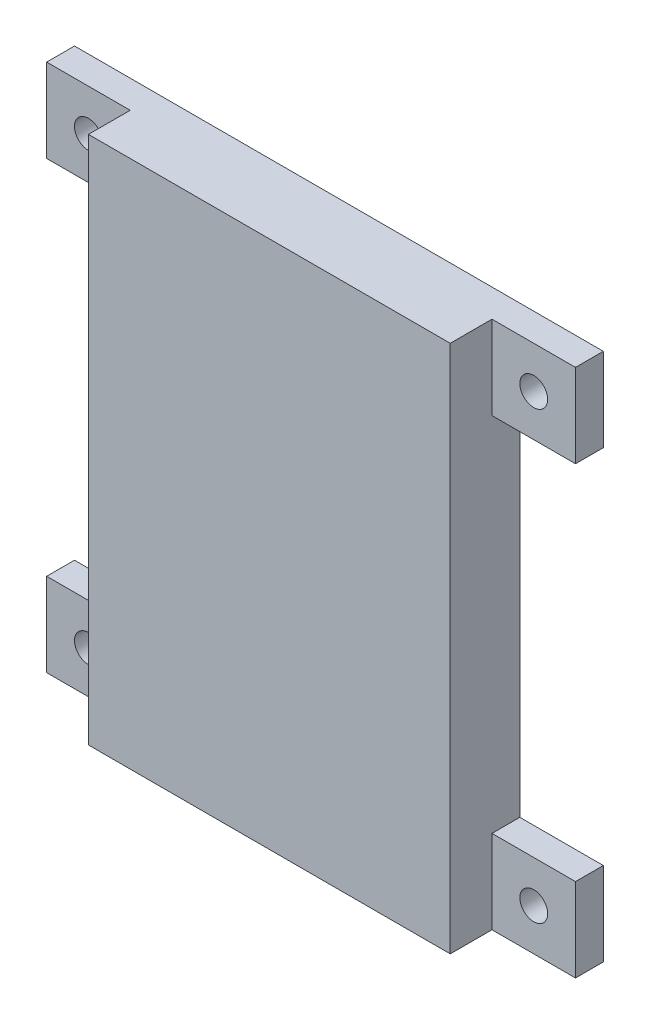
ISO-10303-21;
HEADER;
FILE_DESCRIPTION(('STEP AP214'),'2;1');
FILE_NAME('part.step','',(''),(''),'','','');
FILE_SCHEMA(('AUTOMOTIVE_DESIGN { 1 0 10303 214 1 1 1 1 }'));
ENDSEC;
DATA;
#1=APPLICATION_CONTEXT('core data for automotive mechanical design processes');
#2=APPLICATION_PROTOCOL_DEFINITION('international standard','automotive_design',2000,#1);
#3=PRODUCT_CONTEXT('',#1,'mechanical');
#4=PRODUCT('Part','Part','',(#3));
#5=PRODUCT_RELATED_PRODUCT_CATEGORY('part','',(#4));
#6=PRODUCT_DEFINITION_FORMATION('','',#4);
#7=PRODUCT_DEFINITION_CONTEXT('part definition',#1,'design');
#8=PRODUCT_DEFINITION('design','',#6,#7);
#9=PRODUCT_DEFINITION_SHAPE('','',#8);
#10=(LENGTH_UNIT() NAMED_UNIT(*) SI_UNIT(.MILLI.,.METRE.));
#11=(NAMED_UNIT(*) PLANE_ANGLE_UNIT() SI_UNIT($,.RADIAN.));
#12=(NAMED_UNIT(*) SI_UNIT($,.STERADIAN.) SOLID_ANGLE_UNIT());
#13=UNCERTAINTY_MEASURE_WITH_UNIT(LENGTH_MEASURE(1.E-05),#10,'distance_accuracy_value','');
#14=(GEOMETRIC_REPRESENTATION_CONTEXT(3) GLOBAL_UNCERTAINTY_ASSIGNED_CONTEXT((#13)) GLOBAL_UNIT_ASSIGNED_CONTEXT((#10,
#11,#12)) REPRESENTATION_CONTEXT('',''));
#15=CARTESIAN_POINT('',(0.,0.,0.));
#16=DIRECTION('',(0.,0.,1.));
#17=DIRECTION('',(1.,0.,0.));
#18=AXIS2_PLACEMENT_3D('',#15,#16,#17);
#19=CARTESIAN_POINT('',(-13.,19.,0.));
#20=DIRECTION('',(0.,0.,1.));
#21=DIRECTION('',(1.,0.,0.));
#22=AXIS2_PLACEMENT_3D('',#19,#20,#21);
#23=PLANE('',#22);
#24=CARTESIAN_POINT('',(16.,-16.,0.));
#25=DIRECTION('',(0.,0.,1.));
#26=DIRECTION('',(1.,0.,0.));
#27=AXIS2_PLACEMENT_3D('',#24,#25,#26);
#28=CIRCLE('',#27,1.00000000000001);
#29=CARTESIAN_POINT('',(17.,-16.,0.));
#30=VERTEX_POINT('',#29);
#31=EDGE_CURVE('E618',#30,#30,#28,.T.);
#32=ORIENTED_EDGE('',*,*,#31,.T.);
#33=EDGE_LOOP('',(#32));
#34=FACE_BOUND('',#33,.T.);
#35=CARTESIAN_POINT('',(-16.,16.,0.));
#36=DIRECTION('',(0.,0.,1.));
#37=DIRECTION('',(1.,0.,0.));
#38=AXIS2_PLACEMENT_3D('',#35,#36,#37);
#39=CIRCLE('',#38,1.);
#40=CARTESIAN_POINT('',(-15.,16.,0.));
#41=VERTEX_POINT('',#40);
#42=EDGE_CURVE('E629',#41,#41,#39,.T.);
#43=ORIENTED_EDGE('',*,*,#42,.T.);
#44=EDGE_LOOP('',(#43));
#45=FACE_BOUND('',#44,.T.);
#46=DIRECTION('',(0.,-1.,0.));
#47=VECTOR('',#46,1.);
#48=CARTESIAN_POINT('',(-13.,-19.,0.));
#49=LINE('',#48,#47);
#50=CARTESIAN_POINT('',(-13.,13.,0.));
#51=VERTEX_POINT('',#50);
#52=CARTESIAN_POINT('',(-13.,-13.,0.));
#53=VERTEX_POINT('',#52);
#54=EDGE_CURVE('E37',#51,#53,#49,.T.);
#55=ORIENTED_EDGE('',*,*,#54,.F.);
#56=DIRECTION('',(1.,0.,0.));
#57=VECTOR('',#56,1.);
#58=CARTESIAN_POINT('',(-13.,13.,0.));
#59=LINE('',#58,#57);
#60=CARTESIAN_POINT('',(-19.,13.,0.));
#61=VERTEX_POINT('',#60);
#62=EDGE_CURVE('E201',#61,#51,#59,.T.);
#63=ORIENTED_EDGE('',*,*,#62,.F.);
#64=DIRECTION('',(0.,-1.,0.));
#65=VECTOR('',#64,1.);
#66=CARTESIAN_POINT('',(-19.,19.,0.));
#67=LINE('',#66,#65);
#68=CARTESIAN_POINT('',(-19.,19.,0.));
#69=VERTEX_POINT('',#68);
#70=EDGE_CURVE('E199',#69,#61,#67,.T.);
#71=ORIENTED_EDGE('',*,*,#70,.F.);
#72=DIRECTION('',(-1.,0.,0.));
#73=VECTOR('',#72,1.);
#74=CARTESIAN_POINT('',(13.,19.,0.));
#75=LINE('',#74,#73);
#76=CARTESIAN_POINT('',(19.,19.,0.));
#77=VERTEX_POINT('',#76);
#78=EDGE_CURVE('E185',#77,#69,#75,.T.);
#79=ORIENTED_EDGE('',*,*,#78,.F.);
#80=DIRECTION('',(0.,1.,0.));
#81=VECTOR('',#80,1.);
#82=CARTESIAN_POINT('',(19.,19.,0.));
#83=LINE('',#82,#81);
#84=CARTESIAN_POINT('',(19.,13.,0.));
#85=VERTEX_POINT('',#84);
#86=EDGE_CURVE('E314',#85,#77,#83,.T.);
#87=ORIENTED_EDGE('',*,*,#86,.F.);
#88=DIRECTION('',(1.,0.,0.));
#89=VECTOR('',#88,1.);
#90=CARTESIAN_POINT('',(13.,13.,0.));
#91=LINE('',#90,#89);
#92=CARTESIAN_POINT('',(13.,13.,0.));
#93=VERTEX_POINT('',#92);
#94=EDGE_CURVE('E312',#93,#85,#91,.T.);
#95=ORIENTED_EDGE('',*,*,#94,.F.);
#96=DIRECTION('',(0.,1.,0.));
#97=VECTOR('',#96,1.);
#98=CARTESIAN_POINT('',(13.,-19.,0.));
#99=LINE('',#98,#97);
#100=CARTESIAN_POINT('',(13.,-13.,0.));
#101=VERTEX_POINT('',#100);
#102=EDGE_CURVE('E242',#101,#93,#99,.T.);
#103=ORIENTED_EDGE('',*,*,#102,.F.);
#104=DIRECTION('',(-1.,0.,0.));
#105=VECTOR('',#104,1.);
#106=CARTESIAN_POINT('',(13.,-13.,0.));
#107=LINE('',#106,#105);
#108=CARTESIAN_POINT('',(19.,-13.,0.));
#109=VERTEX_POINT('',#108);
#110=EDGE_CURVE('E367',#109,#101,#107,.T.);
#111=ORIENTED_EDGE('',*,*,#110,.F.);
#112=DIRECTION('',(0.,1.,0.));
#113=VECTOR('',#112,1.);
#114=CARTESIAN_POINT('',(19.,-19.,0.));
#115=LINE('',#114,#113);
#116=CARTESIAN_POINT('',(19.,-19.,0.));
#117=VERTEX_POINT('',#116);
#118=EDGE_CURVE('E229',#117,#109,#115,.T.);
#119=ORIENTED_EDGE('',*,*,#118,.F.);
#120=DIRECTION('',(1.,0.,0.));
#121=VECTOR('',#120,1.);
#122=CARTESIAN_POINT('',(13.,-19.,0.));
#123=LINE('',#122,#121);
#124=CARTESIAN_POINT('',(-19.,-19.,0.));
#125=VERTEX_POINT('',#124);
#126=EDGE_CURVE('E262',#125,#117,#123,.T.);
#127=ORIENTED_EDGE('',*,*,#126,.F.);
#128=DIRECTION('',(0.,-1.,0.));
#129=VECTOR('',#128,1.);
#130=CARTESIAN_POINT('',(-19.,-19.,0.));
#131=LINE('',#130,#129);
#132=CARTESIAN_POINT('',(-19.,-13.,0.));
#133=VERTEX_POINT('',#132);
#134=EDGE_CURVE('E213',#133,#125,#131,.T.);
#135=ORIENTED_EDGE('',*,*,#134,.F.);
#136=DIRECTION('',(-1.,0.,0.));
#137=VECTOR('',#136,1.);
#138=CARTESIAN_POINT('',(-13.,-13.,0.));
#139=LINE('',#138,#137);
#140=EDGE_CURVE('E188',#53,#133,#139,.T.);
#141=ORIENTED_EDGE('',*,*,#140,.F.);
#142=EDGE_LOOP('',(#55,#63,#71,#79,#87,#95,#103,#111,#119,#127,#135,#141));
#143=FACE_BOUND('',#142,.T.);
#144=DIRECTION('',(0.,-1.,0.));
#145=VECTOR('',#144,1.);
#146=CARTESIAN_POINT('',(-11.,-17.,0.));
#147=LINE('',#146,#145);
#148=CARTESIAN_POINT('',(-11.,17.,0.));
#149=VERTEX_POINT('',#148);
#150=CARTESIAN_POINT('',(-11.,-17.,0.));
#151=VERTEX_POINT('',#150);
#152=EDGE_CURVE('E293',#149,#151,#147,.T.);
#153=ORIENTED_EDGE('',*,*,#152,.T.);
#154=DIRECTION('',(1.,0.,0.));
#155=VECTOR('',#154,1.);
#156=CARTESIAN_POINT('',(11.,-17.,0.));
#157=LINE('',#156,#155);
#158=CARTESIAN_POINT('',(11.,-17.,0.));
#159=VERTEX_POINT('',#158);
#160=EDGE_CURVE('E290',#151,#159,#157,.T.);
#161=ORIENTED_EDGE('',*,*,#160,.T.);
#162=DIRECTION('',(0.,1.,0.));
#163=VECTOR('',#162,1.);
#164=CARTESIAN_POINT('',(11.,-17.,0.));
#165=LINE('',#164,#163);
#166=CARTESIAN_POINT('',(11.,17.,0.));
#167=VERTEX_POINT('',#166);
#168=EDGE_CURVE('E287',#159,#167,#165,.T.);
#169=ORIENTED_EDGE('',*,*,#168,.T.);
#170=DIRECTION('',(-1.,0.,0.));
#171=VECTOR('',#170,1.);
#172=CARTESIAN_POINT('',(11.,17.,0.));
#173=LINE('',#172,#171);
#174=EDGE_CURVE('E283',#167,#149,#173,.T.);
#175=ORIENTED_EDGE('',*,*,#174,.T.);
#176=EDGE_LOOP('',(#153,#161,#169,#175));
#177=FACE_BOUND('',#176,.T.);
#178=CARTESIAN_POINT('',(-16.,-16.,0.));
#179=DIRECTION('',(0.,0.,1.));
#180=DIRECTION('',(1.,0.,0.));
#181=AXIS2_PLACEMENT_3D('',#178,#179,#180);
#182=CIRCLE('',#181,1.);
#183=CARTESIAN_POINT('',(-15.,-16.,0.));
#184=VERTEX_POINT('',#183);
#185=EDGE_CURVE('E624',#184,#184,#182,.T.);
#186=ORIENTED_EDGE('',*,*,#185,.T.);
#187=EDGE_LOOP('',(#186));
#188=FACE_BOUND('',#187,.T.);
#189=CARTESIAN_POINT('',(16.,16.,0.));
#190=DIRECTION('',(0.,0.,1.));
#191=DIRECTION('',(1.,0.,0.));
#192=AXIS2_PLACEMENT_3D('',#189,#190,#191);
#193=CIRCLE('',#192,1.);
#194=CARTESIAN_POINT('',(17.,16.,0.));
#195=VERTEX_POINT('',#194);
#196=EDGE_CURVE('E615',#195,#195,#193,.T.);
#197=ORIENTED_EDGE('',*,*,#196,.T.);
#198=EDGE_LOOP('',(#197));
#199=FACE_BOUND('',#198,.T.);
#200=ADVANCED_FACE('F33',(#34,#45,#143,#177,#188,#199),#23,.F.);
#201=CARTESIAN_POINT('',(13.,13.,2.));
#202=DIRECTION('',(0.,0.,1.));
#203=DIRECTION('',(1.,0.,0.));
#204=AXIS2_PLACEMENT_3D('',#201,#202,#203);
#205=PLANE('',#204);
#206=DIRECTION('',(0.,-1.,0.));
#207=VECTOR('',#206,1.);
#208=CARTESIAN_POINT('',(13.,19.,2.));
#209=LINE('',#208,#207);
#210=CARTESIAN_POINT('',(13.,19.,2.));
#211=VERTEX_POINT('',#210);
#212=CARTESIAN_POINT('',(13.,13.,2.));
#213=VERTEX_POINT('',#212);
#214=EDGE_CURVE('E253',#211,#213,#209,.T.);
#215=ORIENTED_EDGE('',*,*,#214,.T.);
#216=DIRECTION('',(1.,0.,0.));
#217=VECTOR('',#216,1.);
#218=CARTESIAN_POINT('',(13.,13.,2.));
#219=LINE('',#218,#217);
#220=CARTESIAN_POINT('',(19.,13.,2.));
#221=VERTEX_POINT('',#220);
#222=EDGE_CURVE('E326',#213,#221,#219,.T.);
#223=ORIENTED_EDGE('',*,*,#222,.T.);
#224=DIRECTION('',(0.,1.,0.));
#225=VECTOR('',#224,1.);
#226=CARTESIAN_POINT('',(19.,19.,2.));
#227=LINE('',#226,#225);
#228=CARTESIAN_POINT('',(19.,19.,2.));
#229=VERTEX_POINT('',#228);
#230=EDGE_CURVE('E321',#221,#229,#227,.T.);
#231=ORIENTED_EDGE('',*,*,#230,.T.);
#232=DIRECTION('',(-1.,0.,0.));
#233=VECTOR('',#232,1.);
#234=CARTESIAN_POINT('',(13.,19.,2.));
#235=LINE('',#234,#233);
#236=EDGE_CURVE('E318',#229,#211,#235,.T.);
#237=ORIENTED_EDGE('',*,*,#236,.T.);
#238=EDGE_LOOP('',(#215,#223,#231,#237));
#239=FACE_BOUND('',#238,.T.);
#240=CARTESIAN_POINT('',(16.,16.,2.));
#241=DIRECTION('',(0.,0.,1.));
#242=DIRECTION('',(1.,0.,0.));
#243=AXIS2_PLACEMENT_3D('',#240,#241,#242);
#244=CIRCLE('',#243,1.);
#245=CARTESIAN_POINT('',(17.,16.,2.));
#246=VERTEX_POINT('',#245);
#247=EDGE_CURVE('E612',#246,#246,#244,.T.);
#248=ORIENTED_EDGE('',*,*,#247,.F.);
#249=EDGE_LOOP('',(#248));
#250=FACE_BOUND('',#249,.T.);
#251=ADVANCED_FACE('F337',(#239,#250),#205,.T.);
#252=CARTESIAN_POINT('',(13.,-13.,2.));
#253=DIRECTION('',(0.,0.,-1.));
#254=DIRECTION('',(-1.,0.,0.));
#255=AXIS2_PLACEMENT_3D('',#252,#253,#254);
#256=PLANE('',#255);
#257=DIRECTION('',(0.,-1.,0.));
#258=VECTOR('',#257,1.);
#259=CARTESIAN_POINT('',(13.,-19.,2.));
#260=LINE('',#259,#258);
#261=CARTESIAN_POINT('',(13.,-13.,2.));
#262=VERTEX_POINT('',#261);
#263=CARTESIAN_POINT('',(13.,-19.,2.));
#264=VERTEX_POINT('',#263);
#265=EDGE_CURVE('E225',#262,#264,#260,.T.);
#266=ORIENTED_EDGE('',*,*,#265,.T.);
#267=DIRECTION('',(1.,0.,0.));
#268=VECTOR('',#267,1.);
#269=CARTESIAN_POINT('',(13.,-19.,2.));
#270=LINE('',#269,#268);
#271=CARTESIAN_POINT('',(19.,-19.,2.));
#272=VERTEX_POINT('',#271);
#273=EDGE_CURVE('E356',#264,#272,#270,.T.);
#274=ORIENTED_EDGE('',*,*,#273,.T.);
#275=DIRECTION('',(0.,1.,0.));
#276=VECTOR('',#275,1.);
#277=CARTESIAN_POINT('',(19.,-19.,2.));
#278=LINE('',#277,#276);
#279=CARTESIAN_POINT('',(19.,-13.,2.));
#280=VERTEX_POINT('',#279);
#281=EDGE_CURVE('E361',#272,#280,#278,.T.);
#282=ORIENTED_EDGE('',*,*,#281,.T.);
#283=DIRECTION('',(-1.,0.,0.));
#284=VECTOR('',#283,1.);
#285=CARTESIAN_POINT('',(13.,-13.,2.));
#286=LINE('',#285,#284);
#287=EDGE_CURVE('E365',#280,#262,#286,.T.);
#288=ORIENTED_EDGE('',*,*,#287,.T.);
#289=EDGE_LOOP('',(#266,#274,#282,#288));
#290=FACE_BOUND('',#289,.T.);
#291=CARTESIAN_POINT('',(16.,-16.,2.));
#292=DIRECTION('',(0.,0.,1.));
#293=DIRECTION('',(1.,0.,0.));
#294=AXIS2_PLACEMENT_3D('',#291,#292,#293);
#295=CIRCLE('',#294,1.00000000000001);
#296=CARTESIAN_POINT('',(17.,-16.,2.));
#297=VERTEX_POINT('',#296);
#298=EDGE_CURVE('E621',#297,#297,#295,.T.);
#299=ORIENTED_EDGE('',*,*,#298,.F.);
#300=EDGE_LOOP('',(#299));
#301=FACE_BOUND('',#300,.T.);
#302=ADVANCED_FACE('F362',(#290,#301),#256,.F.);
#303=CARTESIAN_POINT('',(-13.,-13.,2.));
#304=DIRECTION('',(0.,0.,1.));
#305=DIRECTION('',(1.,0.,0.));
#306=AXIS2_PLACEMENT_3D('',#303,#304,#305);
#307=PLANE('',#306);
#308=DIRECTION('',(0.,1.,0.));
#309=VECTOR('',#308,1.);
#310=CARTESIAN_POINT('',(-13.,-19.,2.));
#311=LINE('',#310,#309);
#312=CARTESIAN_POINT('',(-13.,-19.,2.));
#313=VERTEX_POINT('',#312);
#314=CARTESIAN_POINT('',(-13.,-13.,2.));
#315=VERTEX_POINT('',#314);
#316=EDGE_CURVE('E210',#313,#315,#311,.T.);
#317=ORIENTED_EDGE('',*,*,#316,.T.);
#318=DIRECTION('',(-1.,0.,0.));
#319=VECTOR('',#318,1.);
#320=CARTESIAN_POINT('',(-13.,-13.,2.));
#321=LINE('',#320,#319);
#322=CARTESIAN_POINT('',(-19.,-13.,2.));
#323=VERTEX_POINT('',#322);
#324=EDGE_CURVE('E207',#315,#323,#321,.T.);
#325=ORIENTED_EDGE('',*,*,#324,.T.);
#326=DIRECTION('',(0.,-1.,0.));
#327=VECTOR('',#326,1.);
#328=CARTESIAN_POINT('',(-19.,-19.,2.));
#329=LINE('',#328,#327);
#330=CARTESIAN_POINT('',(-19.,-19.,2.));
#331=VERTEX_POINT('',#330);
#332=EDGE_CURVE('E209',#323,#331,#329,.T.);
#333=ORIENTED_EDGE('',*,*,#332,.T.);
#334=DIRECTION('',(1.,0.,0.));
#335=VECTOR('',#334,1.);
#336=CARTESIAN_POINT('',(-13.,-19.,2.));
#337=LINE('',#336,#335);
#338=EDGE_CURVE('E212',#331,#313,#337,.T.);
#339=ORIENTED_EDGE('',*,*,#338,.T.);
#340=EDGE_LOOP('',(#317,#325,#333,#339));
#341=FACE_BOUND('',#340,.T.);
#342=CARTESIAN_POINT('',(-16.,-16.,2.));
#343=DIRECTION('',(0.,0.,1.));
#344=DIRECTION('',(1.,0.,0.));
#345=AXIS2_PLACEMENT_3D('',#342,#343,#344);
#346=CIRCLE('',#345,1.);
#347=CARTESIAN_POINT('',(-15.,-16.,2.));
#348=VERTEX_POINT('',#347);
#349=EDGE_CURVE('E626',#348,#348,#346,.T.);
#350=ORIENTED_EDGE('',*,*,#349,.F.);
#351=EDGE_LOOP('',(#350));
#352=FACE_BOUND('',#351,.T.);
#353=ADVANCED_FACE('F553',(#341,#352),#307,.T.);
#354=CARTESIAN_POINT('',(-13.,13.,2.));
#355=DIRECTION('',(0.,0.,-1.));
#356=DIRECTION('',(-1.,0.,0.));
#357=AXIS2_PLACEMENT_3D('',#354,#355,#356);
#358=PLANE('',#357);
#359=DIRECTION('',(0.,1.,0.));
#360=VECTOR('',#359,1.);
#361=CARTESIAN_POINT('',(-13.,19.,2.));
#362=LINE('',#361,#360);
#363=CARTESIAN_POINT('',(-13.,13.,2.));
#364=VERTEX_POINT('',#363);
#365=CARTESIAN_POINT('',(-13.,19.,2.));
#366=VERTEX_POINT('',#365);
#367=EDGE_CURVE('E51',#364,#366,#362,.T.);
#368=ORIENTED_EDGE('',*,*,#367,.T.);
#369=DIRECTION('',(-1.,0.,0.));
#370=VECTOR('',#369,1.);
#371=CARTESIAN_POINT('',(-13.,19.,2.));
#372=LINE('',#371,#370);
#373=CARTESIAN_POINT('',(-19.,19.,2.));
#374=VERTEX_POINT('',#373);
#375=EDGE_CURVE('E171',#366,#374,#372,.T.);
#376=ORIENTED_EDGE('',*,*,#375,.T.);
#377=DIRECTION('',(0.,-1.,0.));
#378=VECTOR('',#377,1.);
#379=CARTESIAN_POINT('',(-19.,19.,2.));
#380=LINE('',#379,#378);
#381=CARTESIAN_POINT('',(-19.,13.,2.));
#382=VERTEX_POINT('',#381);
#383=EDGE_CURVE('E176',#374,#382,#380,.T.);
#384=ORIENTED_EDGE('',*,*,#383,.T.);
#385=DIRECTION('',(1.,0.,0.));
#386=VECTOR('',#385,1.);
#387=CARTESIAN_POINT('',(-13.,13.,2.));
#388=LINE('',#387,#386);
#389=EDGE_CURVE('E194',#382,#364,#388,.T.);
#390=ORIENTED_EDGE('',*,*,#389,.T.);
#391=EDGE_LOOP('',(#368,#376,#384,#390));
#392=FACE_BOUND('',#391,.T.);
#393=CARTESIAN_POINT('',(-16.,16.,2.));
#394=DIRECTION('',(0.,0.,1.));
#395=DIRECTION('',(1.,0.,0.));
#396=AXIS2_PLACEMENT_3D('',#393,#394,#395);
#397=CIRCLE('',#396,1.);
#398=CARTESIAN_POINT('',(-15.,16.,2.));
#399=VERTEX_POINT('',#398);
#400=EDGE_CURVE('E202',#399,#399,#397,.T.);
#401=ORIENTED_EDGE('',*,*,#400,.F.);
#402=EDGE_LOOP('',(#401));
#403=FACE_BOUND('',#402,.T.);
#404=ADVANCED_FACE('F173',(#392,#403),#358,.F.);
#405=CARTESIAN_POINT('',(-13.,-19.,5.));
#406=DIRECTION('',(1.,0.,0.));
#407=DIRECTION('',(0.,0.,-1.));
#408=AXIS2_PLACEMENT_3D('',#405,#406,#407);
#409=PLANE('',#408);
#410=DIRECTION('',(0.,0.,-1.));
#411=VECTOR('',#410,1.);
#412=CARTESIAN_POINT('',(-13.,13.,2.));
#413=LINE('',#412,#411);
#414=EDGE_CURVE('E56',#364,#51,#413,.T.);
#415=ORIENTED_EDGE('',*,*,#414,.T.);
#416=ORIENTED_EDGE('',*,*,#54,.T.);
#417=DIRECTION('',(0.,0.,-1.));
#418=VECTOR('',#417,1.);
#419=CARTESIAN_POINT('',(-13.,-13.,2.));
#420=LINE('',#419,#418);
#421=EDGE_CURVE('E222',#315,#53,#420,.T.);
#422=ORIENTED_EDGE('',*,*,#421,.F.);
#423=ORIENTED_EDGE('',*,*,#316,.F.);
#424=DIRECTION('',(0.,0.,-1.));
#425=VECTOR('',#424,1.);
#426=CARTESIAN_POINT('',(-13.,-19.,5.));
#427=LINE('',#426,#425);
#428=CARTESIAN_POINT('',(-13.,-19.,5.));
#429=VERTEX_POINT('',#428);
#430=EDGE_CURVE('E11',#429,#313,#427,.T.);
#431=ORIENTED_EDGE('',*,*,#430,.F.);
#432=DIRECTION('',(0.,-1.,0.));
#433=VECTOR('',#432,1.);
#434=CARTESIAN_POINT('',(-13.,-19.,5.));
#435=LINE('',#434,#433);
#436=CARTESIAN_POINT('',(-13.,19.,5.));
#437=VERTEX_POINT('',#436);
#438=EDGE_CURVE('E259',#437,#429,#435,.T.);
#439=ORIENTED_EDGE('',*,*,#438,.F.);
#440=DIRECTION('',(0.,0.,-1.));
#441=VECTOR('',#440,1.);
#442=CARTESIAN_POINT('',(-13.,19.,5.));
#443=LINE('',#442,#441);
#444=EDGE_CURVE('E252',#437,#366,#443,.T.);
#445=ORIENTED_EDGE('',*,*,#444,.T.);
#446=ORIENTED_EDGE('',*,*,#367,.F.);
#447=EDGE_LOOP('',(#415,#416,#422,#423,#431,#439,#445,#446));
#448=FACE_BOUND('',#447,.T.);
#449=ADVANCED_FACE('F35',(#448),#409,.F.);
#450=CARTESIAN_POINT('',(13.,-19.,5.));
#451=DIRECTION('',(-1.,0.,0.));
#452=DIRECTION('',(0.,0.,1.));
#453=AXIS2_PLACEMENT_3D('',#450,#451,#452);
#454=PLANE('',#453);
#455=DIRECTION('',(0.,0.,-1.));
#456=VECTOR('',#455,1.);
#457=CARTESIAN_POINT('',(13.,-13.,2.));
#458=LINE('',#457,#456);
#459=EDGE_CURVE('E376',#262,#101,#458,.T.);
#460=ORIENTED_EDGE('',*,*,#459,.T.);
#461=ORIENTED_EDGE('',*,*,#102,.T.);
#462=DIRECTION('',(0.,0.,-1.));
#463=VECTOR('',#462,1.);
#464=CARTESIAN_POINT('',(13.,13.,2.));
#465=LINE('',#464,#463);
#466=EDGE_CURVE('E296',#213,#93,#465,.T.);
#467=ORIENTED_EDGE('',*,*,#466,.F.);
#468=ORIENTED_EDGE('',*,*,#214,.F.);
#469=DIRECTION('',(0.,0.,-1.));
#470=VECTOR('',#469,1.);
#471=CARTESIAN_POINT('',(13.,19.,5.));
#472=LINE('',#471,#470);
#473=CARTESIAN_POINT('',(13.,19.,5.));
#474=VERTEX_POINT('',#473);
#475=EDGE_CURVE('E249',#474,#211,#472,.T.);
#476=ORIENTED_EDGE('',*,*,#475,.F.);
#477=DIRECTION('',(0.,1.,0.));
#478=VECTOR('',#477,1.);
#479=CARTESIAN_POINT('',(13.,-19.,5.));
#480=LINE('',#479,#478);
#481=CARTESIAN_POINT('',(13.,-19.,5.));
#482=VERTEX_POINT('',#481);
#483=EDGE_CURVE('E266',#482,#474,#480,.T.);
#484=ORIENTED_EDGE('',*,*,#483,.F.);
#485=DIRECTION('',(0.,0.,-1.));
#486=VECTOR('',#485,1.);
#487=CARTESIAN_POINT('',(13.,-19.,5.));
#488=LINE('',#487,#486);
#489=EDGE_CURVE('E43',#482,#264,#488,.T.);
#490=ORIENTED_EDGE('',*,*,#489,.T.);
#491=ORIENTED_EDGE('',*,*,#265,.F.);
#492=EDGE_LOOP('',(#460,#461,#467,#468,#476,#484,#490,#491));
#493=FACE_BOUND('',#492,.T.);
#494=ADVANCED_FACE('F343',(#493),#454,.F.);
#495=CARTESIAN_POINT('',(13.,-19.,5.));
#496=DIRECTION('',(0.,1.,0.));
#497=DIRECTION('',(-1.,0.,0.));
#498=AXIS2_PLACEMENT_3D('',#495,#496,#497);
#499=PLANE('',#498);
#500=ORIENTED_EDGE('',*,*,#126,.T.);
#501=DIRECTION('',(0.,0.,-1.));
#502=VECTOR('',#501,1.);
#503=CARTESIAN_POINT('',(19.,-19.,2.));
#504=LINE('',#503,#502);
#505=EDGE_CURVE('E315',#272,#117,#504,.T.);
#506=ORIENTED_EDGE('',*,*,#505,.F.);
#507=ORIENTED_EDGE('',*,*,#273,.F.);
#508=ORIENTED_EDGE('',*,*,#489,.F.);
#509=DIRECTION('',(1.,0.,0.));
#510=VECTOR('',#509,1.);
#511=CARTESIAN_POINT('',(13.,-19.,5.));
#512=LINE('',#511,#510);
#513=EDGE_CURVE('E268',#429,#482,#512,.T.);
#514=ORIENTED_EDGE('',*,*,#513,.F.);
#515=ORIENTED_EDGE('',*,*,#430,.T.);
#516=ORIENTED_EDGE('',*,*,#338,.F.);
#517=DIRECTION('',(0.,0.,-1.));
#518=VECTOR('',#517,1.);
#519=CARTESIAN_POINT('',(-19.,-19.,2.));
#520=LINE('',#519,#518);
#521=EDGE_CURVE('E216',#331,#125,#520,.T.);
#522=ORIENTED_EDGE('',*,*,#521,.T.);
#523=EDGE_LOOP('',(#500,#506,#507,#508,#514,#515,#516,#522));
#524=FACE_BOUND('',#523,.T.);
#525=ADVANCED_FACE('F357',(#524),#499,.F.);
#526=CARTESIAN_POINT('',(13.,19.,5.));
#527=DIRECTION('',(0.,-1.,0.));
#528=DIRECTION('',(0.,0.,-1.));
#529=AXIS2_PLACEMENT_3D('',#526,#527,#528);
#530=PLANE('',#529);
#531=ORIENTED_EDGE('',*,*,#78,.T.);
#532=DIRECTION('',(0.,0.,-1.));
#533=VECTOR('',#532,1.);
#534=CARTESIAN_POINT('',(-19.,19.,2.));
#535=LINE('',#534,#533);
#536=EDGE_CURVE('E182',#374,#69,#535,.T.);
#537=ORIENTED_EDGE('',*,*,#536,.F.);
#538=ORIENTED_EDGE('',*,*,#375,.F.);
#539=ORIENTED_EDGE('',*,*,#444,.F.);
#540=DIRECTION('',(-1.,0.,0.));
#541=VECTOR('',#540,1.);
#542=CARTESIAN_POINT('',(13.,19.,5.));
#543=LINE('',#542,#541);
#544=EDGE_CURVE('E258',#474,#437,#543,.T.);
#545=ORIENTED_EDGE('',*,*,#544,.F.);
#546=ORIENTED_EDGE('',*,*,#475,.T.);
#547=ORIENTED_EDGE('',*,*,#236,.F.);
#548=DIRECTION('',(0.,0.,-1.));
#549=VECTOR('',#548,1.);
#550=CARTESIAN_POINT('',(19.,19.,2.));
#551=LINE('',#550,#549);
#552=EDGE_CURVE('E320',#229,#77,#551,.T.);
#553=ORIENTED_EDGE('',*,*,#552,.T.);
#554=EDGE_LOOP('',(#531,#537,#538,#539,#545,#546,#547,#553));
#555=FACE_BOUND('',#554,.T.);
#556=ADVANCED_FACE('F183',(#555),#530,.F.);
#557=CARTESIAN_POINT('',(-13.,19.,5.));
#558=DIRECTION('',(0.,0.,1.));
#559=DIRECTION('',(1.,0.,0.));
#560=AXIS2_PLACEMENT_3D('',#557,#558,#559);
#561=PLANE('',#560);
#562=ORIENTED_EDGE('',*,*,#438,.T.);
#563=ORIENTED_EDGE('',*,*,#513,.T.);
#564=ORIENTED_EDGE('',*,*,#483,.T.);
#565=ORIENTED_EDGE('',*,*,#544,.T.);
#566=EDGE_LOOP('',(#562,#563,#564,#565));
#567=FACE_BOUND('',#566,.T.);
#568=ADVANCED_FACE('F348',(#567),#561,.T.);
#569=CARTESIAN_POINT('',(-11.,-17.,3.));
#570=DIRECTION('',(1.,0.,0.));
#571=DIRECTION('',(0.,0.,-1.));
#572=AXIS2_PLACEMENT_3D('',#569,#570,#571);
#573=PLANE('',#572);
#574=ORIENTED_EDGE('',*,*,#152,.F.);
#575=DIRECTION('',(0.,0.,-1.));
#576=VECTOR('',#575,1.);
#577=CARTESIAN_POINT('',(-11.,17.,3.));
#578=LINE('',#577,#576);
#579=CARTESIAN_POINT('',(-11.,17.,3.));
#580=VERTEX_POINT('',#579);
#581=EDGE_CURVE('E279',#580,#149,#578,.T.);
#582=ORIENTED_EDGE('',*,*,#581,.F.);
#583=DIRECTION('',(0.,-1.,0.));
#584=VECTOR('',#583,1.);
#585=CARTESIAN_POINT('',(-11.,-17.,3.));
#586=LINE('',#585,#584);
#587=CARTESIAN_POINT('',(-11.,-17.,3.));
#588=VERTEX_POINT('',#587);
#589=EDGE_CURVE('E286',#580,#588,#586,.T.);
#590=ORIENTED_EDGE('',*,*,#589,.T.);
#591=DIRECTION('',(0.,0.,-1.));
#592=VECTOR('',#591,1.);
#593=CARTESIAN_POINT('',(-11.,-17.,3.));
#594=LINE('',#593,#592);
#595=EDGE_CURVE('E272',#588,#151,#594,.T.);
#596=ORIENTED_EDGE('',*,*,#595,.T.);
#597=EDGE_LOOP('',(#574,#582,#590,#596));
#598=FACE_BOUND('',#597,.T.);
#599=ADVANCED_FACE('F435',(#598),#573,.T.);
#600=CARTESIAN_POINT('',(11.,-17.,3.));
#601=DIRECTION('',(0.,1.,0.));
#602=DIRECTION('',(-1.,0.,0.));
#603=AXIS2_PLACEMENT_3D('',#600,#601,#602);
#604=PLANE('',#603);
#605=ORIENTED_EDGE('',*,*,#160,.F.);
#606=ORIENTED_EDGE('',*,*,#595,.F.);
#607=DIRECTION('',(1.,0.,0.));
#608=VECTOR('',#607,1.);
#609=CARTESIAN_POINT('',(11.,-17.,3.));
#610=LINE('',#609,#608);
#611=CARTESIAN_POINT('',(11.,-17.,3.));
#612=VERTEX_POINT('',#611);
#613=EDGE_CURVE('E300',#588,#612,#610,.T.);
#614=ORIENTED_EDGE('',*,*,#613,.T.);
#615=DIRECTION('',(0.,0.,-1.));
#616=VECTOR('',#615,1.);
#617=CARTESIAN_POINT('',(11.,-17.,3.));
#618=LINE('',#617,#616);
#619=EDGE_CURVE('E275',#612,#159,#618,.T.);
#620=ORIENTED_EDGE('',*,*,#619,.T.);
#621=EDGE_LOOP('',(#605,#606,#614,#620));
#622=FACE_BOUND('',#621,.T.);
#623=ADVANCED_FACE('F441',(#622),#604,.T.);
#624=CARTESIAN_POINT('',(11.,-17.,3.));
#625=DIRECTION('',(-1.,0.,0.));
#626=DIRECTION('',(0.,0.,1.));
#627=AXIS2_PLACEMENT_3D('',#624,#625,#626);
#628=PLANE('',#627);
#629=ORIENTED_EDGE('',*,*,#168,.F.);
#630=ORIENTED_EDGE('',*,*,#619,.F.);
#631=DIRECTION('',(0.,1.,0.));
#632=VECTOR('',#631,1.);
#633=CARTESIAN_POINT('',(11.,-17.,3.));
#634=LINE('',#633,#632);
#635=CARTESIAN_POINT('',(11.,17.,3.));
#636=VERTEX_POINT('',#635);
#637=EDGE_CURVE('E298',#612,#636,#634,.T.);
#638=ORIENTED_EDGE('',*,*,#637,.T.);
#639=DIRECTION('',(0.,0.,-1.));
#640=VECTOR('',#639,1.);
#641=CARTESIAN_POINT('',(11.,17.,3.));
#642=LINE('',#641,#640);
#643=EDGE_CURVE('E277',#636,#167,#642,.T.);
#644=ORIENTED_EDGE('',*,*,#643,.T.);
#645=EDGE_LOOP('',(#629,#630,#638,#644));
#646=FACE_BOUND('',#645,.T.);
#647=ADVANCED_FACE('F448',(#646),#628,.T.);
#648=CARTESIAN_POINT('',(11.,17.,3.));
#649=DIRECTION('',(0.,-1.,0.));
#650=DIRECTION('',(0.,0.,-1.));
#651=AXIS2_PLACEMENT_3D('',#648,#649,#650);
#652=PLANE('',#651);
#653=ORIENTED_EDGE('',*,*,#174,.F.);
#654=ORIENTED_EDGE('',*,*,#643,.F.);
#655=DIRECTION('',(-1.,0.,0.));
#656=VECTOR('',#655,1.);
#657=CARTESIAN_POINT('',(11.,17.,3.));
#658=LINE('',#657,#656);
#659=EDGE_CURVE('E282',#636,#580,#658,.T.);
#660=ORIENTED_EDGE('',*,*,#659,.T.);
#661=ORIENTED_EDGE('',*,*,#581,.T.);
#662=EDGE_LOOP('',(#653,#654,#660,#661));
#663=FACE_BOUND('',#662,.T.);
#664=ADVANCED_FACE('F456',(#663),#652,.T.);
#665=CARTESIAN_POINT('',(-11.,17.,3.));
#666=DIRECTION('',(0.,0.,1.));
#667=DIRECTION('',(1.,0.,0.));
#668=AXIS2_PLACEMENT_3D('',#665,#666,#667);
#669=PLANE('',#668);
#670=ORIENTED_EDGE('',*,*,#589,.F.);
#671=ORIENTED_EDGE('',*,*,#659,.F.);
#672=ORIENTED_EDGE('',*,*,#637,.F.);
#673=ORIENTED_EDGE('',*,*,#613,.F.);
#674=EDGE_LOOP('',(#670,#671,#672,#673));
#675=FACE_BOUND('',#674,.T.);
#676=ADVANCED_FACE('F464',(#675),#669,.F.);
#677=CARTESIAN_POINT('',(13.,13.,2.));
#678=DIRECTION('',(0.,1.,0.));
#679=DIRECTION('',(-1.,0.,0.));
#680=AXIS2_PLACEMENT_3D('',#677,#678,#679);
#681=PLANE('',#680);
#682=ORIENTED_EDGE('',*,*,#94,.T.);
#683=DIRECTION('',(0.,0.,-1.));
#684=VECTOR('',#683,1.);
#685=CARTESIAN_POINT('',(19.,13.,2.));
#686=LINE('',#685,#684);
#687=EDGE_CURVE('E306',#221,#85,#686,.T.);
#688=ORIENTED_EDGE('',*,*,#687,.F.);
#689=ORIENTED_EDGE('',*,*,#222,.F.);
#690=ORIENTED_EDGE('',*,*,#466,.T.);
#691=EDGE_LOOP('',(#682,#688,#689,#690));
#692=FACE_BOUND('',#691,.T.);
#693=ADVANCED_FACE('F472',(#692),#681,.F.);
#694=CARTESIAN_POINT('',(19.,19.,2.));
#695=DIRECTION('',(-1.,0.,0.));
#696=DIRECTION('',(0.,-1.,0.));
#697=AXIS2_PLACEMENT_3D('',#694,#695,#696);
#698=PLANE('',#697);
#699=ORIENTED_EDGE('',*,*,#86,.T.);
#700=ORIENTED_EDGE('',*,*,#552,.F.);
#701=ORIENTED_EDGE('',*,*,#230,.F.);
#702=ORIENTED_EDGE('',*,*,#687,.T.);
#703=EDGE_LOOP('',(#699,#700,#701,#702));
#704=FACE_BOUND('',#703,.T.);
#705=ADVANCED_FACE('F400',(#704),#698,.F.);
#706=CARTESIAN_POINT('',(19.,-19.,2.));
#707=DIRECTION('',(-1.,0.,0.));
#708=DIRECTION('',(0.,0.,1.));
#709=AXIS2_PLACEMENT_3D('',#706,#707,#708);
#710=PLANE('',#709);
#711=ORIENTED_EDGE('',*,*,#118,.T.);
#712=DIRECTION('',(0.,0.,-1.));
#713=VECTOR('',#712,1.);
#714=CARTESIAN_POINT('',(19.,-13.,2.));
#715=LINE('',#714,#713);
#716=EDGE_CURVE('E378',#280,#109,#715,.T.);
#717=ORIENTED_EDGE('',*,*,#716,.F.);
#718=ORIENTED_EDGE('',*,*,#281,.F.);
#719=ORIENTED_EDGE('',*,*,#505,.T.);
#720=EDGE_LOOP('',(#711,#717,#718,#719));
#721=FACE_BOUND('',#720,.T.);
#722=ADVANCED_FACE('F381',(#721),#710,.F.);
#723=CARTESIAN_POINT('',(13.,-13.,2.));
#724=DIRECTION('',(0.,-1.,0.));
#725=DIRECTION('',(0.,0.,-1.));
#726=AXIS2_PLACEMENT_3D('',#723,#724,#725);
#727=PLANE('',#726);
#728=ORIENTED_EDGE('',*,*,#110,.T.);
#729=ORIENTED_EDGE('',*,*,#459,.F.);
#730=ORIENTED_EDGE('',*,*,#287,.F.);
#731=ORIENTED_EDGE('',*,*,#716,.T.);
#732=EDGE_LOOP('',(#728,#729,#730,#731));
#733=FACE_BOUND('',#732,.T.);
#734=ADVANCED_FACE('F388',(#733),#727,.F.);
#735=CARTESIAN_POINT('',(-13.,-13.,2.));
#736=DIRECTION('',(0.,-1.,0.));
#737=DIRECTION('',(0.,0.,-1.));
#738=AXIS2_PLACEMENT_3D('',#735,#736,#737);
#739=PLANE('',#738);
#740=ORIENTED_EDGE('',*,*,#140,.T.);
#741=DIRECTION('',(0.,0.,-1.));
#742=VECTOR('',#741,1.);
#743=CARTESIAN_POINT('',(-19.,-13.,2.));
#744=LINE('',#743,#742);
#745=EDGE_CURVE('E219',#323,#133,#744,.T.);
#746=ORIENTED_EDGE('',*,*,#745,.F.);
#747=ORIENTED_EDGE('',*,*,#324,.F.);
#748=ORIENTED_EDGE('',*,*,#421,.T.);
#749=EDGE_LOOP('',(#740,#746,#747,#748));
#750=FACE_BOUND('',#749,.T.);
#751=ADVANCED_FACE('F391',(#750),#739,.F.);
#752=CARTESIAN_POINT('',(-19.,-19.,2.));
#753=DIRECTION('',(1.,0.,0.));
#754=DIRECTION('',(0.,0.,-1.));
#755=AXIS2_PLACEMENT_3D('',#752,#753,#754);
#756=PLANE('',#755);
#757=ORIENTED_EDGE('',*,*,#134,.T.);
#758=ORIENTED_EDGE('',*,*,#521,.F.);
#759=ORIENTED_EDGE('',*,*,#332,.F.);
#760=ORIENTED_EDGE('',*,*,#745,.T.);
#761=EDGE_LOOP('',(#757,#758,#759,#760));
#762=FACE_BOUND('',#761,.T.);
#763=ADVANCED_FACE('F397',(#762),#756,.F.);
#764=CARTESIAN_POINT('',(-19.,19.,2.));
#765=DIRECTION('',(1.,0.,0.));
#766=DIRECTION('',(0.,0.,-1.));
#767=AXIS2_PLACEMENT_3D('',#764,#765,#766);
#768=PLANE('',#767);
#769=ORIENTED_EDGE('',*,*,#70,.T.);
#770=DIRECTION('',(0.,0.,-1.));
#771=VECTOR('',#770,1.);
#772=CARTESIAN_POINT('',(-19.,13.,2.));
#773=LINE('',#772,#771);
#774=EDGE_CURVE('E189',#382,#61,#773,.T.);
#775=ORIENTED_EDGE('',*,*,#774,.F.);
#776=ORIENTED_EDGE('',*,*,#383,.F.);
#777=ORIENTED_EDGE('',*,*,#536,.T.);
#778=EDGE_LOOP('',(#769,#775,#776,#777));
#779=FACE_BOUND('',#778,.T.);
#780=ADVANCED_FACE('F191',(#779),#768,.F.);
#781=CARTESIAN_POINT('',(-13.,13.,2.));
#782=DIRECTION('',(0.,1.,0.));
#783=DIRECTION('',(0.,0.,1.));
#784=AXIS2_PLACEMENT_3D('',#781,#782,#783);
#785=PLANE('',#784);
#786=ORIENTED_EDGE('',*,*,#62,.T.);
#787=ORIENTED_EDGE('',*,*,#414,.F.);
#788=ORIENTED_EDGE('',*,*,#389,.F.);
#789=ORIENTED_EDGE('',*,*,#774,.T.);
#790=EDGE_LOOP('',(#786,#787,#788,#789));
#791=FACE_BOUND('',#790,.T.);
#792=ADVANCED_FACE('F519',(#791),#785,.F.);
#793=CARTESIAN_POINT('',(-16.,16.,2.));
#794=DIRECTION('',(0.,0.,-1.));
#795=DIRECTION('',(-1.,0.,0.));
#796=AXIS2_PLACEMENT_3D('',#793,#794,#795);
#797=CYLINDRICAL_SURFACE('',#796,1.);
#798=ORIENTED_EDGE('',*,*,#400,.T.);
#799=EDGE_LOOP('',(#798));
#800=FACE_BOUND('',#799,.T.);
#801=ORIENTED_EDGE('',*,*,#42,.F.);
#802=EDGE_LOOP('',(#801));
#803=FACE_BOUND('',#802,.T.);
#804=ADVANCED_FACE('F527',(#800,#803),#797,.F.);
#805=CARTESIAN_POINT('',(-16.,-16.,2.));
#806=DIRECTION('',(0.,0.,-1.));
#807=DIRECTION('',(-1.,0.,0.));
#808=AXIS2_PLACEMENT_3D('',#805,#806,#807);
#809=CYLINDRICAL_SURFACE('',#808,1.);
#810=ORIENTED_EDGE('',*,*,#349,.T.);
#811=EDGE_LOOP('',(#810));
#812=FACE_BOUND('',#811,.T.);
#813=ORIENTED_EDGE('',*,*,#185,.F.);
#814=EDGE_LOOP('',(#813));
#815=FACE_BOUND('',#814,.T.);
#816=ADVANCED_FACE('F575',(#812,#815),#809,.F.);
#817=CARTESIAN_POINT('',(16.,-16.,2.));
#818=DIRECTION('',(0.,0.,-1.));
#819=DIRECTION('',(-1.,0.,0.));
#820=AXIS2_PLACEMENT_3D('',#817,#818,#819);
#821=CYLINDRICAL_SURFACE('',#820,1.00000000000001);
#822=ORIENTED_EDGE('',*,*,#298,.T.);
#823=EDGE_LOOP('',(#822));
#824=FACE_BOUND('',#823,.T.);
#825=ORIENTED_EDGE('',*,*,#31,.F.);
#826=EDGE_LOOP('',(#825));
#827=FACE_BOUND('',#826,.T.);
#828=ADVANCED_FACE('F585',(#824,#827),#821,.F.);
#829=CARTESIAN_POINT('',(16.,16.,2.));
#830=DIRECTION('',(0.,0.,-1.));
#831=DIRECTION('',(-1.,0.,0.));
#832=AXIS2_PLACEMENT_3D('',#829,#830,#831);
#833=CYLINDRICAL_SURFACE('',#832,1.);
#834=ORIENTED_EDGE('',*,*,#247,.T.);
#835=EDGE_LOOP('',(#834));
#836=FACE_BOUND('',#835,.T.);
#837=ORIENTED_EDGE('',*,*,#196,.F.);
#838=EDGE_LOOP('',(#837));
#839=FACE_BOUND('',#838,.T.);
#840=ADVANCED_FACE('F595',(#836,#839),#833,.F.);
#841=CLOSED_SHELL('',(#200,#251,#302,#353,#404,#449,#494,#525,#556,#568,#599,#623,#647,#664,
#676,#693,#705,#722,#734,#751,#763,#780,#792,#804,#816,#828,#840));
#842=MANIFOLD_SOLID_BREP('B2',#841);
#843=ADVANCED_BREP_SHAPE_REPRESENTATION('',(#18,#842),#14);
#844=SHAPE_DEFINITION_REPRESENTATION(#9,#843);
ENDSEC;
END-ISO-10303-21;
